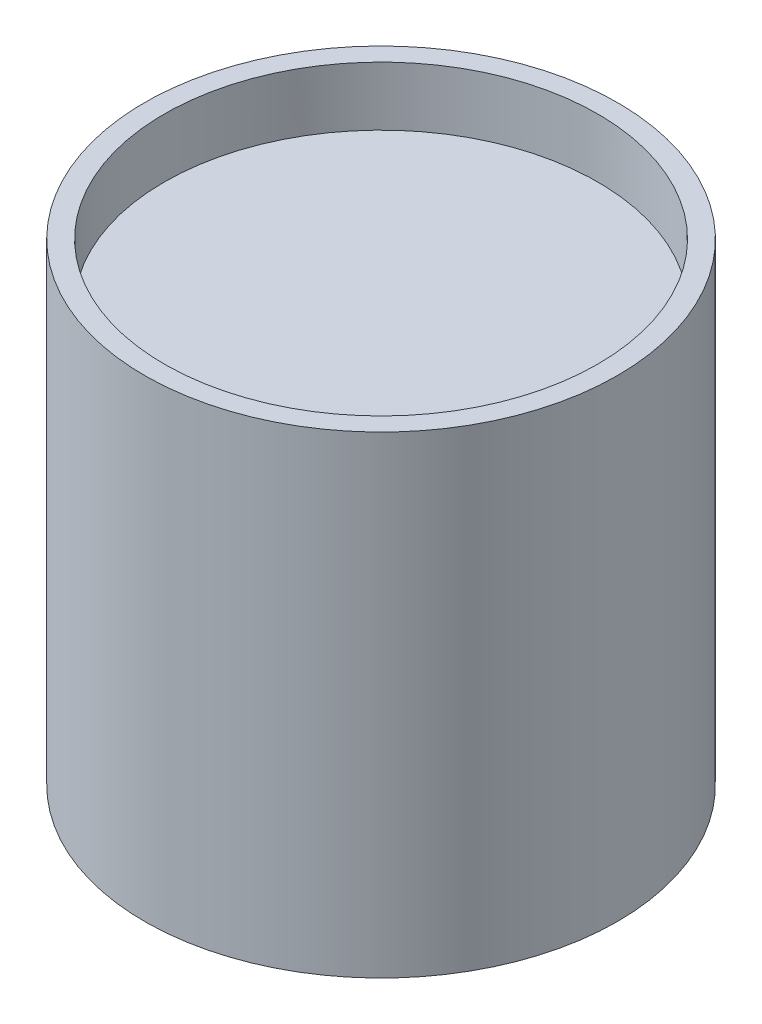
ISO-10303-21;
HEADER;
FILE_DESCRIPTION(('STEP AP214'),'2;1');
FILE_NAME('part.step','',(''),(''),'','','');
FILE_SCHEMA(('AUTOMOTIVE_DESIGN { 1 0 10303 214 1 1 1 1 }'));
ENDSEC;
DATA;
#1=APPLICATION_CONTEXT('core data for automotive mechanical design processes');
#2=APPLICATION_PROTOCOL_DEFINITION('international standard','automotive_design',2000,#1);
#3=PRODUCT_CONTEXT('',#1,'mechanical');
#4=PRODUCT('Part','Part','',(#3));
#5=PRODUCT_RELATED_PRODUCT_CATEGORY('part','',(#4));
#6=PRODUCT_DEFINITION_FORMATION('','',#4);
#7=PRODUCT_DEFINITION_CONTEXT('part definition',#1,'design');
#8=PRODUCT_DEFINITION('design','',#6,#7);
#9=PRODUCT_DEFINITION_SHAPE('','',#8);
#10=(LENGTH_UNIT() NAMED_UNIT(*) SI_UNIT(.MILLI.,.METRE.));
#11=(NAMED_UNIT(*) PLANE_ANGLE_UNIT() SI_UNIT($,.RADIAN.));
#12=(NAMED_UNIT(*) SI_UNIT($,.STERADIAN.) SOLID_ANGLE_UNIT());
#13=UNCERTAINTY_MEASURE_WITH_UNIT(LENGTH_MEASURE(1.E-05),#10,'distance_accuracy_value','');
#14=(GEOMETRIC_REPRESENTATION_CONTEXT(3) GLOBAL_UNCERTAINTY_ASSIGNED_CONTEXT((#13)) GLOBAL_UNIT_ASSIGNED_CONTEXT((#10,
#11,#12)) REPRESENTATION_CONTEXT('',''));
#15=CARTESIAN_POINT('',(0.,0.,0.));
#16=DIRECTION('',(0.,0.,1.));
#17=DIRECTION('',(1.,0.,0.));
#18=AXIS2_PLACEMENT_3D('',#15,#16,#17);
#19=CARTESIAN_POINT('',(3.49148336110938E-12,-1000.,0.));
#20=DIRECTION('',(0.,-1.,0.));
#21=DIRECTION('',(1.,0.,0.));
#22=AXIS2_PLACEMENT_3D('',#19,#20,#21);
#23=CYLINDRICAL_SURFACE('',#22,34.9250000000002);
#24=CARTESIAN_POINT('',(-2.66051032116535E-13,76.1999999999998,0.));
#25=DIRECTION('',(0.,-1.,0.));
#26=DIRECTION('',(1.,0.,0.));
#27=AXIS2_PLACEMENT_3D('',#24,#25,#26);
#28=CIRCLE('',#27,34.9250000000003);
#29=CARTESIAN_POINT('',(34.925,76.1999999999999,0.));
#30=VERTEX_POINT('',#29);
#31=EDGE_CURVE('E10',#30,#30,#28,.T.);
#32=ORIENTED_EDGE('',*,*,#31,.F.);
#33=EDGE_LOOP('',(#32));
#34=FACE_BOUND('',#33,.T.);
#35=CARTESIAN_POINT('',(0.,66.7003999999998,0.));
#36=DIRECTION('',(0.,1.,0.));
#37=DIRECTION('',(-1.,0.,0.));
#38=AXIS2_PLACEMENT_3D('',#35,#36,#37);
#39=CIRCLE('',#38,34.9250000000001);
#40=CARTESIAN_POINT('',(-34.9250000000001,66.7003999999998,0.));
#41=VERTEX_POINT('',#40);
#42=EDGE_CURVE('E60',#41,#41,#39,.T.);
#43=ORIENTED_EDGE('',*,*,#42,.F.);
#44=EDGE_LOOP('',(#43));
#45=FACE_BOUND('',#44,.T.);
#46=ADVANCED_FACE('F36',(#34,#45),#23,.F.);
#47=CARTESIAN_POINT('',(38.1,76.2,0.));
#48=DIRECTION('',(0.,1.,0.));
#49=DIRECTION('',(-1.,0.,0.));
#50=AXIS2_PLACEMENT_3D('',#47,#48,#49);
#51=PLANE('',#50);
#52=ORIENTED_EDGE('',*,*,#31,.T.);
#53=EDGE_LOOP('',(#52));
#54=FACE_BOUND('',#53,.T.);
#55=CARTESIAN_POINT('',(-2.66051032116535E-13,76.1999999999998,0.));
#56=DIRECTION('',(0.,-1.,0.));
#57=DIRECTION('',(1.,0.,0.));
#58=AXIS2_PLACEMENT_3D('',#55,#56,#57);
#59=CIRCLE('',#58,38.1000000000003);
#60=CARTESIAN_POINT('',(38.1,76.2,0.));
#61=VERTEX_POINT('',#60);
#62=EDGE_CURVE('E52',#61,#61,#59,.T.);
#63=ORIENTED_EDGE('',*,*,#62,.F.);
#64=EDGE_LOOP('',(#63));
#65=FACE_BOUND('',#64,.T.);
#66=ADVANCED_FACE('F38',(#54,#65),#51,.T.);
#67=CARTESIAN_POINT('',(0.,0.,0.));
#68=DIRECTION('',(0.,-1.,0.));
#69=DIRECTION('',(1.,0.,0.));
#70=AXIS2_PLACEMENT_3D('',#67,#68,#69);
#71=PLANE('',#70);
#72=CARTESIAN_POINT('',(0.,-1.11022302462516E-13,0.));
#73=DIRECTION('',(0.,-1.,0.));
#74=DIRECTION('',(1.,0.,0.));
#75=AXIS2_PLACEMENT_3D('',#72,#73,#74);
#76=CIRCLE('',#75,38.1);
#77=CARTESIAN_POINT('',(38.1,0.,0.));
#78=VERTEX_POINT('',#77);
#79=EDGE_CURVE('E48',#78,#78,#76,.T.);
#80=ORIENTED_EDGE('',*,*,#79,.T.);
#81=EDGE_LOOP('',(#80));
#82=FACE_BOUND('',#81,.T.);
#83=ADVANCED_FACE('F72',(#82),#71,.T.);
#84=CARTESIAN_POINT('',(3.49148336110938E-12,-1000.,0.));
#85=DIRECTION('',(0.,-1.,0.));
#86=DIRECTION('',(1.,0.,0.));
#87=AXIS2_PLACEMENT_3D('',#84,#85,#86);
#88=CYLINDRICAL_SURFACE('',#87,38.1000000000001);
#89=ORIENTED_EDGE('',*,*,#62,.T.);
#90=EDGE_LOOP('',(#89));
#91=FACE_BOUND('',#90,.T.);
#92=ORIENTED_EDGE('',*,*,#79,.F.);
#93=EDGE_LOOP('',(#92));
#94=FACE_BOUND('',#93,.T.);
#95=ADVANCED_FACE('F92',(#91,#94),#88,.T.);
#96=CARTESIAN_POINT('',(34.9250000000001,66.7003999999998,0.));
#97=DIRECTION('',(0.,-1.,0.));
#98=DIRECTION('',(1.,0.,0.));
#99=AXIS2_PLACEMENT_3D('',#96,#97,#98);
#100=PLANE('',#99);
#101=ORIENTED_EDGE('',*,*,#42,.T.);
#102=EDGE_LOOP('',(#101));
#103=FACE_BOUND('',#102,.T.);
#104=ADVANCED_FACE('F64',(#103),#100,.F.);
#105=CLOSED_SHELL('',(#46,#66,#83,#95,#104));
#106=CARTESIAN_POINT('',(0.,3.20039999999976,0.));
#107=DIRECTION('',(0.,1.,0.));
#108=DIRECTION('',(-1.,0.,0.));
#109=AXIS2_PLACEMENT_3D('',#106,#107,#108);
#110=PLANE('',#109);
#111=CARTESIAN_POINT('',(0.,3.20039999999976,0.));
#112=DIRECTION('',(0.,1.,0.));
#113=DIRECTION('',(-1.,0.,0.));
#114=AXIS2_PLACEMENT_3D('',#111,#112,#113);
#115=CIRCLE('',#114,34.9250000000001);
#116=CARTESIAN_POINT('',(-34.9250000000001,3.20039999999975,0.));
#117=VERTEX_POINT('',#116);
#118=EDGE_CURVE('E57',#117,#117,#115,.T.);
#119=ORIENTED_EDGE('',*,*,#118,.F.);
#120=EDGE_LOOP('',(#119));
#121=FACE_BOUND('',#120,.T.);
#122=ADVANCED_FACE('F80',(#121),#110,.F.);
#123=CARTESIAN_POINT('',(34.925,3.17500000000006,0.));
#124=DIRECTION('',(0.,1.,0.));
#125=DIRECTION('',(-1.,0.,0.));
#126=AXIS2_PLACEMENT_3D('',#123,#124,#125);
#127=PLANE('',#126);
#128=CARTESIAN_POINT('',(0.,3.17499999999971,0.));
#129=DIRECTION('',(0.,-1.,0.));
#130=DIRECTION('',(1.,0.,0.));
#131=AXIS2_PLACEMENT_3D('',#128,#129,#130);
#132=CIRCLE('',#131,34.925);
#133=CARTESIAN_POINT('',(34.925,3.17499999999983,0.));
#134=VERTEX_POINT('',#133);
#135=EDGE_CURVE('E44',#134,#134,#132,.T.);
#136=ORIENTED_EDGE('',*,*,#135,.F.);
#137=EDGE_LOOP('',(#136));
#138=FACE_BOUND('',#137,.T.);
#139=ADVANCED_FACE('F75',(#138),#127,.T.);
#140=ORIENTED_EDGE('',*,*,#135,.T.);
#141=EDGE_LOOP('',(#140));
#142=FACE_BOUND('',#141,.T.);
#143=ORIENTED_EDGE('',*,*,#118,.T.);
#144=EDGE_LOOP('',(#143));
#145=FACE_BOUND('',#144,.T.);
#146=ADVANCED_FACE('F68',(#142,#145),#23,.F.);
#147=CLOSED_SHELL('',(#122,#139,#146));
#148=ORIENTED_CLOSED_SHELL('',*,#147,.T.);
#149=BREP_WITH_VOIDS('B2',#105,(#148));
#150=ADVANCED_BREP_SHAPE_REPRESENTATION('',(#18,#149),#14);
#151=SHAPE_DEFINITION_REPRESENTATION(#9,#150);
ENDSEC;
END-ISO-10303-21;
